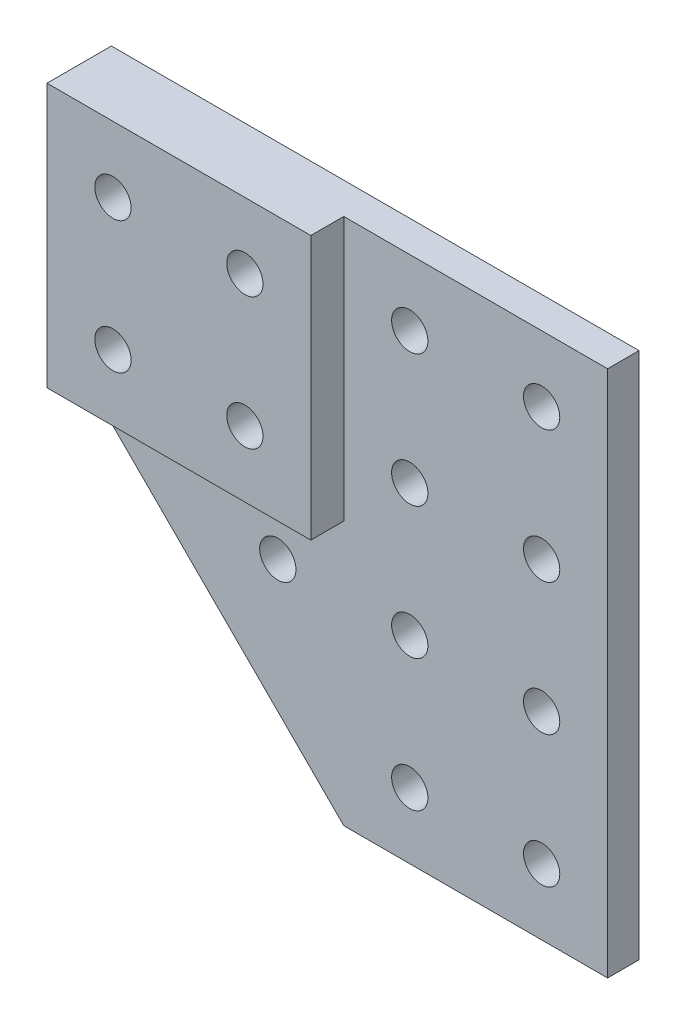
ISO-10303-21;
HEADER;
FILE_DESCRIPTION(('STEP AP214'),'2;1');
FILE_NAME('part.step','',(''),(''),'','','');
FILE_SCHEMA(('AUTOMOTIVE_DESIGN { 1 0 10303 214 1 1 1 1 }'));
ENDSEC;
DATA;
#1=APPLICATION_CONTEXT('core data for automotive mechanical design processes');
#2=APPLICATION_PROTOCOL_DEFINITION('international standard','automotive_design',2000,#1);
#3=PRODUCT_CONTEXT('',#1,'mechanical');
#4=PRODUCT('Part','Part','',(#3));
#5=PRODUCT_RELATED_PRODUCT_CATEGORY('part','',(#4));
#6=PRODUCT_DEFINITION_FORMATION('','',#4);
#7=PRODUCT_DEFINITION_CONTEXT('part definition',#1,'design');
#8=PRODUCT_DEFINITION('design','',#6,#7);
#9=PRODUCT_DEFINITION_SHAPE('','',#8);
#10=(LENGTH_UNIT() NAMED_UNIT(*) SI_UNIT(.MILLI.,.METRE.));
#11=(NAMED_UNIT(*) PLANE_ANGLE_UNIT() SI_UNIT($,.RADIAN.));
#12=(NAMED_UNIT(*) SI_UNIT($,.STERADIAN.) SOLID_ANGLE_UNIT());
#13=UNCERTAINTY_MEASURE_WITH_UNIT(LENGTH_MEASURE(1.E-05),#10,'distance_accuracy_value','');
#14=(GEOMETRIC_REPRESENTATION_CONTEXT(3) GLOBAL_UNCERTAINTY_ASSIGNED_CONTEXT((#13)) GLOBAL_UNIT_ASSIGNED_CONTEXT((#10,
#11,#12)) REPRESENTATION_CONTEXT('',''));
#15=CARTESIAN_POINT('',(0.,0.,0.));
#16=DIRECTION('',(0.,0.,1.));
#17=DIRECTION('',(1.,0.,0.));
#18=AXIS2_PLACEMENT_3D('',#15,#16,#17);
#19=CARTESIAN_POINT('',(0.,0.,0.));
#20=DIRECTION('',(0.,0.,-1.));
#21=DIRECTION('',(1.,0.,0.));
#22=AXIS2_PLACEMENT_3D('',#19,#20,#21);
#23=PLANE('',#22);
#24=CARTESIAN_POINT('',(50.,70.,0.));
#25=DIRECTION('',(0.,0.,1.));
#26=DIRECTION('',(1.,0.,0.));
#27=AXIS2_PLACEMENT_3D('',#24,#25,#26);
#28=CIRCLE('',#27,2.74999999999999);
#29=CARTESIAN_POINT('',(52.75,70.,0.));
#30=VERTEX_POINT('',#29);
#31=EDGE_CURVE('E223',#30,#30,#28,.T.);
#32=ORIENTED_EDGE('',*,*,#31,.F.);
#33=EDGE_LOOP('',(#32));
#34=FACE_BOUND('',#33,.T.);
#35=CARTESIAN_POINT('',(70.,70.,0.));
#36=DIRECTION('',(0.,0.,1.));
#37=DIRECTION('',(1.,0.,0.));
#38=AXIS2_PLACEMENT_3D('',#35,#36,#37);
#39=CIRCLE('',#38,2.75);
#40=CARTESIAN_POINT('',(72.75,70.,0.));
#41=VERTEX_POINT('',#40);
#42=EDGE_CURVE('E217',#41,#41,#39,.T.);
#43=ORIENTED_EDGE('',*,*,#42,.F.);
#44=EDGE_LOOP('',(#43));
#45=FACE_BOUND('',#44,.T.);
#46=CARTESIAN_POINT('',(50.0000000000002,50.,0.));
#47=DIRECTION('',(0.,0.,1.));
#48=DIRECTION('',(1.,0.,0.));
#49=AXIS2_PLACEMENT_3D('',#46,#47,#48);
#50=CIRCLE('',#49,2.74999999999999);
#51=CARTESIAN_POINT('',(52.7500000000002,50.,0.));
#52=VERTEX_POINT('',#51);
#53=EDGE_CURVE('E205',#52,#52,#50,.T.);
#54=ORIENTED_EDGE('',*,*,#53,.F.);
#55=EDGE_LOOP('',(#54));
#56=FACE_BOUND('',#55,.T.);
#57=CARTESIAN_POINT('',(70.0000000000002,50.,0.));
#58=DIRECTION('',(0.,0.,1.));
#59=DIRECTION('',(1.,0.,0.));
#60=AXIS2_PLACEMENT_3D('',#57,#58,#59);
#61=CIRCLE('',#60,2.75);
#62=CARTESIAN_POINT('',(72.7500000000002,50.,0.));
#63=VERTEX_POINT('',#62);
#64=EDGE_CURVE('E199',#63,#63,#61,.T.);
#65=ORIENTED_EDGE('',*,*,#64,.F.);
#66=EDGE_LOOP('',(#65));
#67=FACE_BOUND('',#66,.T.);
#68=CARTESIAN_POINT('',(30.0000000000004,30.,0.));
#69=DIRECTION('',(0.,0.,1.));
#70=DIRECTION('',(1.,0.,0.));
#71=AXIS2_PLACEMENT_3D('',#68,#69,#70);
#72=CIRCLE('',#71,2.74999999999999);
#73=CARTESIAN_POINT('',(32.7500000000004,30.,0.));
#74=VERTEX_POINT('',#73);
#75=EDGE_CURVE('E193',#74,#74,#72,.T.);
#76=ORIENTED_EDGE('',*,*,#75,.F.);
#77=EDGE_LOOP('',(#76));
#78=FACE_BOUND('',#77,.T.);
#79=CARTESIAN_POINT('',(50.0000000000004,30.,0.));
#80=DIRECTION('',(0.,0.,1.));
#81=DIRECTION('',(1.,0.,0.));
#82=AXIS2_PLACEMENT_3D('',#79,#80,#81);
#83=CIRCLE('',#82,2.74999999999999);
#84=CARTESIAN_POINT('',(52.7500000000004,30.,0.));
#85=VERTEX_POINT('',#84);
#86=EDGE_CURVE('E187',#85,#85,#83,.T.);
#87=ORIENTED_EDGE('',*,*,#86,.F.);
#88=EDGE_LOOP('',(#87));
#89=FACE_BOUND('',#88,.T.);
#90=CARTESIAN_POINT('',(70.0000000000004,30.,0.));
#91=DIRECTION('',(0.,0.,1.));
#92=DIRECTION('',(1.,0.,0.));
#93=AXIS2_PLACEMENT_3D('',#90,#91,#92);
#94=CIRCLE('',#93,2.75);
#95=CARTESIAN_POINT('',(72.7500000000004,30.,0.));
#96=VERTEX_POINT('',#95);
#97=EDGE_CURVE('E181',#96,#96,#94,.T.);
#98=ORIENTED_EDGE('',*,*,#97,.F.);
#99=EDGE_LOOP('',(#98));
#100=FACE_BOUND('',#99,.T.);
#101=CARTESIAN_POINT('',(50.0000000000006,10.,0.));
#102=DIRECTION('',(0.,0.,1.));
#103=DIRECTION('',(1.,0.,0.));
#104=AXIS2_PLACEMENT_3D('',#101,#102,#103);
#105=CIRCLE('',#104,2.74999999999999);
#106=CARTESIAN_POINT('',(52.7500000000006,10.,0.));
#107=VERTEX_POINT('',#106);
#108=EDGE_CURVE('E175',#107,#107,#105,.T.);
#109=ORIENTED_EDGE('',*,*,#108,.F.);
#110=EDGE_LOOP('',(#109));
#111=FACE_BOUND('',#110,.T.);
#112=CARTESIAN_POINT('',(70.0000000000006,10.,0.));
#113=DIRECTION('',(0.,0.,1.));
#114=DIRECTION('',(1.,0.,0.));
#115=AXIS2_PLACEMENT_3D('',#112,#113,#114);
#116=CIRCLE('',#115,2.75);
#117=CARTESIAN_POINT('',(72.7500000000006,10.,0.));
#118=VERTEX_POINT('',#117);
#119=EDGE_CURVE('E169',#118,#118,#116,.T.);
#120=ORIENTED_EDGE('',*,*,#119,.F.);
#121=EDGE_LOOP('',(#120));
#122=FACE_BOUND('',#121,.T.);
#123=DIRECTION('',(0.,-1.,0.));
#124=VECTOR('',#123,1.);
#125=CARTESIAN_POINT('',(40.,0.,0.));
#126=LINE('',#125,#124);
#127=CARTESIAN_POINT('',(40.,80.,0.));
#128=VERTEX_POINT('',#127);
#129=CARTESIAN_POINT('',(40.,40.,0.));
#130=VERTEX_POINT('',#129);
#131=EDGE_CURVE('E155',#128,#130,#126,.T.);
#132=ORIENTED_EDGE('',*,*,#131,.T.);
#133=DIRECTION('',(1.,0.,0.));
#134=VECTOR('',#133,1.);
#135=CARTESIAN_POINT('',(0.,40.,0.));
#136=LINE('',#135,#134);
#137=CARTESIAN_POINT('',(0.,40.,0.));
#138=VERTEX_POINT('',#137);
#139=EDGE_CURVE('E152',#138,#130,#136,.T.);
#140=ORIENTED_EDGE('',*,*,#139,.F.);
#141=DIRECTION('',(-0.707106781186548,0.707106781186548,0.));
#142=VECTOR('',#141,1.);
#143=CARTESIAN_POINT('',(20.,20.,0.));
#144=LINE('',#143,#142);
#145=CARTESIAN_POINT('',(40.,0.,0.));
#146=VERTEX_POINT('',#145);
#147=EDGE_CURVE('E128',#146,#138,#144,.T.);
#148=ORIENTED_EDGE('',*,*,#147,.F.);
#149=DIRECTION('',(1.,0.,0.));
#150=VECTOR('',#149,1.);
#151=CARTESIAN_POINT('',(0.,0.,0.));
#152=LINE('',#151,#150);
#153=CARTESIAN_POINT('',(80.,0.,0.));
#154=VERTEX_POINT('',#153);
#155=EDGE_CURVE('E120',#146,#154,#152,.T.);
#156=ORIENTED_EDGE('',*,*,#155,.T.);
#157=DIRECTION('',(0.,1.,0.));
#158=VECTOR('',#157,1.);
#159=CARTESIAN_POINT('',(80.,0.,0.));
#160=LINE('',#159,#158);
#161=CARTESIAN_POINT('',(80.,80.,0.));
#162=VERTEX_POINT('',#161);
#163=EDGE_CURVE('E123',#154,#162,#160,.T.);
#164=ORIENTED_EDGE('',*,*,#163,.T.);
#165=DIRECTION('',(1.,0.,0.));
#166=VECTOR('',#165,1.);
#167=CARTESIAN_POINT('',(0.,80.,0.));
#168=LINE('',#167,#166);
#169=EDGE_CURVE('E126',#128,#162,#168,.T.);
#170=ORIENTED_EDGE('',*,*,#169,.F.);
#171=EDGE_LOOP('',(#132,#140,#148,#156,#164,#170));
#172=FACE_BOUND('',#171,.T.);
#173=ADVANCED_FACE('F35',(#34,#45,#56,#67,#78,#89,#100,#111,#122,#172),#23,.F.);
#174=CARTESIAN_POINT('',(0.,0.,-4.7625));
#175=DIRECTION('',(0.,1.,0.));
#176=DIRECTION('',(0.,0.,-1.));
#177=AXIS2_PLACEMENT_3D('',#174,#175,#176);
#178=PLANE('',#177);
#179=ORIENTED_EDGE('',*,*,#155,.F.);
#180=DIRECTION('',(0.,0.,1.));
#181=VECTOR('',#180,1.);
#182=CARTESIAN_POINT('',(40.,0.,-4.7625));
#183=LINE('',#182,#181);
#184=CARTESIAN_POINT('',(40.,0.,-4.7625));
#185=VERTEX_POINT('',#184);
#186=EDGE_CURVE('E74',#185,#146,#183,.T.);
#187=ORIENTED_EDGE('',*,*,#186,.F.);
#188=DIRECTION('',(1.,0.,0.));
#189=VECTOR('',#188,1.);
#190=CARTESIAN_POINT('',(0.,0.,-4.7625));
#191=LINE('',#190,#189);
#192=CARTESIAN_POINT('',(80.,0.,-4.7625));
#193=VERTEX_POINT('',#192);
#194=EDGE_CURVE('E115',#185,#193,#191,.T.);
#195=ORIENTED_EDGE('',*,*,#194,.T.);
#196=DIRECTION('',(0.,0.,1.));
#197=VECTOR('',#196,1.);
#198=CARTESIAN_POINT('',(80.,0.,-4.7625));
#199=LINE('',#198,#197);
#200=EDGE_CURVE('E11',#193,#154,#199,.T.);
#201=ORIENTED_EDGE('',*,*,#200,.T.);
#202=EDGE_LOOP('',(#179,#187,#195,#201));
#203=FACE_BOUND('',#202,.T.);
#204=ADVANCED_FACE('F37',(#203),#178,.F.);
#205=CARTESIAN_POINT('',(80.,0.,-4.7625));
#206=DIRECTION('',(-1.,0.,0.));
#207=DIRECTION('',(0.,0.,-1.));
#208=AXIS2_PLACEMENT_3D('',#205,#206,#207);
#209=PLANE('',#208);
#210=ORIENTED_EDGE('',*,*,#163,.F.);
#211=ORIENTED_EDGE('',*,*,#200,.F.);
#212=DIRECTION('',(0.,1.,0.));
#213=VECTOR('',#212,1.);
#214=CARTESIAN_POINT('',(80.,0.,-4.7625));
#215=LINE('',#214,#213);
#216=CARTESIAN_POINT('',(80.,80.,-4.7625));
#217=VERTEX_POINT('',#216);
#218=EDGE_CURVE('E82',#193,#217,#215,.T.);
#219=ORIENTED_EDGE('',*,*,#218,.T.);
#220=DIRECTION('',(0.,0.,1.));
#221=VECTOR('',#220,1.);
#222=CARTESIAN_POINT('',(80.,80.,-4.7625));
#223=LINE('',#222,#221);
#224=EDGE_CURVE('E43',#217,#162,#223,.T.);
#225=ORIENTED_EDGE('',*,*,#224,.T.);
#226=EDGE_LOOP('',(#210,#211,#219,#225));
#227=FACE_BOUND('',#226,.T.);
#228=ADVANCED_FACE('F133',(#227),#209,.F.);
#229=CARTESIAN_POINT('',(0.,80.,-4.7625));
#230=DIRECTION('',(0.,1.,0.));
#231=DIRECTION('',(0.,0.,-1.));
#232=AXIS2_PLACEMENT_3D('',#229,#230,#231);
#233=PLANE('',#232);
#234=ORIENTED_EDGE('',*,*,#169,.T.);
#235=ORIENTED_EDGE('',*,*,#224,.F.);
#236=DIRECTION('',(1.,0.,0.));
#237=VECTOR('',#236,1.);
#238=CARTESIAN_POINT('',(0.,80.,-4.7625));
#239=LINE('',#238,#237);
#240=CARTESIAN_POINT('',(0.,80.,-4.7625));
#241=VERTEX_POINT('',#240);
#242=EDGE_CURVE('E94',#241,#217,#239,.T.);
#243=ORIENTED_EDGE('',*,*,#242,.F.);
#244=DIRECTION('',(0.,0.,1.));
#245=VECTOR('',#244,1.);
#246=CARTESIAN_POINT('',(0.,80.,-4.7625));
#247=LINE('',#246,#245);
#248=CARTESIAN_POINT('',(0.,80.,5.));
#249=VERTEX_POINT('',#248);
#250=EDGE_CURVE('E101',#241,#249,#247,.T.);
#251=ORIENTED_EDGE('',*,*,#250,.T.);
#252=DIRECTION('',(1.,0.,0.));
#253=VECTOR('',#252,1.);
#254=CARTESIAN_POINT('',(0.,80.,5.));
#255=LINE('',#254,#253);
#256=CARTESIAN_POINT('',(40.,80.,5.));
#257=VERTEX_POINT('',#256);
#258=EDGE_CURVE('E161',#249,#257,#255,.T.);
#259=ORIENTED_EDGE('',*,*,#258,.T.);
#260=DIRECTION('',(0.,0.,-1.));
#261=VECTOR('',#260,1.);
#262=CARTESIAN_POINT('',(40.,80.,5.));
#263=LINE('',#262,#261);
#264=EDGE_CURVE('E138',#257,#128,#263,.T.);
#265=ORIENTED_EDGE('',*,*,#264,.T.);
#266=EDGE_LOOP('',(#234,#235,#243,#251,#259,#265));
#267=FACE_BOUND('',#266,.T.);
#268=ADVANCED_FACE('F113',(#267),#233,.T.);
#269=CARTESIAN_POINT('',(0.,0.,-4.7625));
#270=DIRECTION('',(-1.,0.,0.));
#271=DIRECTION('',(0.,0.,-1.));
#272=AXIS2_PLACEMENT_3D('',#269,#270,#271);
#273=PLANE('',#272);
#274=ORIENTED_EDGE('',*,*,#250,.F.);
#275=DIRECTION('',(0.,1.,0.));
#276=VECTOR('',#275,1.);
#277=CARTESIAN_POINT('',(0.,0.,-4.7625));
#278=LINE('',#277,#276);
#279=CARTESIAN_POINT('',(0.,40.,-4.7625));
#280=VERTEX_POINT('',#279);
#281=EDGE_CURVE('E90',#280,#241,#278,.T.);
#282=ORIENTED_EDGE('',*,*,#281,.F.);
#283=DIRECTION('',(0.,0.,1.));
#284=VECTOR('',#283,1.);
#285=CARTESIAN_POINT('',(0.,40.,-4.7625));
#286=LINE('',#285,#284);
#287=EDGE_CURVE('E110',#280,#138,#286,.T.);
#288=ORIENTED_EDGE('',*,*,#287,.T.);
#289=DIRECTION('',(0.,0.,-1.));
#290=VECTOR('',#289,1.);
#291=CARTESIAN_POINT('',(0.,40.,5.));
#292=LINE('',#291,#290);
#293=CARTESIAN_POINT('',(0.,40.,5.));
#294=VERTEX_POINT('',#293);
#295=EDGE_CURVE('E147',#294,#138,#292,.T.);
#296=ORIENTED_EDGE('',*,*,#295,.F.);
#297=DIRECTION('',(0.,1.,0.));
#298=VECTOR('',#297,1.);
#299=CARTESIAN_POINT('',(0.,0.,5.));
#300=LINE('',#299,#298);
#301=EDGE_CURVE('E106',#294,#249,#300,.T.);
#302=ORIENTED_EDGE('',*,*,#301,.T.);
#303=EDGE_LOOP('',(#274,#282,#288,#296,#302));
#304=FACE_BOUND('',#303,.T.);
#305=ADVANCED_FACE('F102',(#304),#273,.T.);
#306=CARTESIAN_POINT('',(20.,20.,-4.7625));
#307=DIRECTION('',(-0.707106781186548,-0.707106781186548,0.));
#308=DIRECTION('',(0.707106781186548,-0.707106781186548,0.));
#309=AXIS2_PLACEMENT_3D('',#306,#307,#308);
#310=PLANE('',#309);
#311=ORIENTED_EDGE('',*,*,#147,.T.);
#312=ORIENTED_EDGE('',*,*,#287,.F.);
#313=DIRECTION('',(-0.707106781186548,0.707106781186548,0.));
#314=VECTOR('',#313,1.);
#315=CARTESIAN_POINT('',(20.,20.,-4.7625));
#316=LINE('',#315,#314);
#317=EDGE_CURVE('E59',#185,#280,#316,.T.);
#318=ORIENTED_EDGE('',*,*,#317,.F.);
#319=ORIENTED_EDGE('',*,*,#186,.T.);
#320=EDGE_LOOP('',(#311,#312,#318,#319));
#321=FACE_BOUND('',#320,.T.);
#322=ADVANCED_FACE('F266',(#321),#310,.T.);
#323=CARTESIAN_POINT('',(0.,0.,-4.7625));
#324=DIRECTION('',(0.,0.,-1.));
#325=DIRECTION('',(1.,0.,0.));
#326=AXIS2_PLACEMENT_3D('',#323,#324,#325);
#327=PLANE('',#326);
#328=CARTESIAN_POINT('',(10.,70.,-4.7625));
#329=DIRECTION('',(0.,0.,1.));
#330=DIRECTION('',(1.,0.,0.));
#331=AXIS2_PLACEMENT_3D('',#328,#329,#330);
#332=CIRCLE('',#331,2.74999999999999);
#333=CARTESIAN_POINT('',(12.75,70.,-4.7625));
#334=VERTEX_POINT('',#333);
#335=EDGE_CURVE('E238',#334,#334,#332,.T.);
#336=ORIENTED_EDGE('',*,*,#335,.T.);
#337=EDGE_LOOP('',(#336));
#338=FACE_BOUND('',#337,.T.);
#339=CARTESIAN_POINT('',(30.,70.,-4.7625));
#340=DIRECTION('',(0.,0.,1.));
#341=DIRECTION('',(1.,0.,0.));
#342=AXIS2_PLACEMENT_3D('',#339,#340,#341);
#343=CIRCLE('',#342,2.74999999999999);
#344=CARTESIAN_POINT('',(32.75,70.,-4.7625));
#345=VERTEX_POINT('',#344);
#346=EDGE_CURVE('E232',#345,#345,#343,.T.);
#347=ORIENTED_EDGE('',*,*,#346,.T.);
#348=EDGE_LOOP('',(#347));
#349=FACE_BOUND('',#348,.T.);
#350=CARTESIAN_POINT('',(50.,70.,-4.7625));
#351=DIRECTION('',(0.,0.,1.));
#352=DIRECTION('',(1.,0.,0.));
#353=AXIS2_PLACEMENT_3D('',#350,#351,#352);
#354=CIRCLE('',#353,2.74999999999999);
#355=CARTESIAN_POINT('',(52.75,70.,-4.7625));
#356=VERTEX_POINT('',#355);
#357=EDGE_CURVE('E226',#356,#356,#354,.T.);
#358=ORIENTED_EDGE('',*,*,#357,.T.);
#359=EDGE_LOOP('',(#358));
#360=FACE_BOUND('',#359,.T.);
#361=CARTESIAN_POINT('',(70.,70.,-4.7625));
#362=DIRECTION('',(0.,0.,1.));
#363=DIRECTION('',(1.,0.,0.));
#364=AXIS2_PLACEMENT_3D('',#361,#362,#363);
#365=CIRCLE('',#364,2.74999999999999);
#366=CARTESIAN_POINT('',(72.75,70.,-4.7625));
#367=VERTEX_POINT('',#366);
#368=EDGE_CURVE('E220',#367,#367,#365,.T.);
#369=ORIENTED_EDGE('',*,*,#368,.T.);
#370=EDGE_LOOP('',(#369));
#371=FACE_BOUND('',#370,.T.);
#372=CARTESIAN_POINT('',(30.0000000000002,50.,-4.7625));
#373=DIRECTION('',(0.,0.,1.));
#374=DIRECTION('',(1.,0.,0.));
#375=AXIS2_PLACEMENT_3D('',#372,#373,#374);
#376=CIRCLE('',#375,2.74999999999999);
#377=CARTESIAN_POINT('',(32.7500000000002,50.,-4.7625));
#378=VERTEX_POINT('',#377);
#379=EDGE_CURVE('E214',#378,#378,#376,.T.);
#380=ORIENTED_EDGE('',*,*,#379,.T.);
#381=EDGE_LOOP('',(#380));
#382=FACE_BOUND('',#381,.T.);
#383=CARTESIAN_POINT('',(50.0000000000002,50.,-4.7625));
#384=DIRECTION('',(0.,0.,1.));
#385=DIRECTION('',(1.,0.,0.));
#386=AXIS2_PLACEMENT_3D('',#383,#384,#385);
#387=CIRCLE('',#386,2.74999999999999);
#388=CARTESIAN_POINT('',(52.7500000000002,50.,-4.7625));
#389=VERTEX_POINT('',#388);
#390=EDGE_CURVE('E208',#389,#389,#387,.T.);
#391=ORIENTED_EDGE('',*,*,#390,.T.);
#392=EDGE_LOOP('',(#391));
#393=FACE_BOUND('',#392,.T.);
#394=CARTESIAN_POINT('',(70.0000000000002,50.,-4.7625));
#395=DIRECTION('',(0.,0.,1.));
#396=DIRECTION('',(1.,0.,0.));
#397=AXIS2_PLACEMENT_3D('',#394,#395,#396);
#398=CIRCLE('',#397,2.74999999999999);
#399=CARTESIAN_POINT('',(72.7500000000002,50.,-4.7625));
#400=VERTEX_POINT('',#399);
#401=EDGE_CURVE('E202',#400,#400,#398,.T.);
#402=ORIENTED_EDGE('',*,*,#401,.T.);
#403=EDGE_LOOP('',(#402));
#404=FACE_BOUND('',#403,.T.);
#405=CARTESIAN_POINT('',(30.0000000000004,30.,-4.7625));
#406=DIRECTION('',(0.,0.,1.));
#407=DIRECTION('',(1.,0.,0.));
#408=AXIS2_PLACEMENT_3D('',#405,#406,#407);
#409=CIRCLE('',#408,2.74999999999999);
#410=CARTESIAN_POINT('',(32.7500000000004,30.,-4.7625));
#411=VERTEX_POINT('',#410);
#412=EDGE_CURVE('E196',#411,#411,#409,.T.);
#413=ORIENTED_EDGE('',*,*,#412,.T.);
#414=EDGE_LOOP('',(#413));
#415=FACE_BOUND('',#414,.T.);
#416=CARTESIAN_POINT('',(50.0000000000004,30.,-4.7625));
#417=DIRECTION('',(0.,0.,1.));
#418=DIRECTION('',(1.,0.,0.));
#419=AXIS2_PLACEMENT_3D('',#416,#417,#418);
#420=CIRCLE('',#419,2.74999999999999);
#421=CARTESIAN_POINT('',(52.7500000000004,30.,-4.7625));
#422=VERTEX_POINT('',#421);
#423=EDGE_CURVE('E190',#422,#422,#420,.T.);
#424=ORIENTED_EDGE('',*,*,#423,.T.);
#425=EDGE_LOOP('',(#424));
#426=FACE_BOUND('',#425,.T.);
#427=CARTESIAN_POINT('',(70.0000000000004,30.,-4.7625));
#428=DIRECTION('',(0.,0.,1.));
#429=DIRECTION('',(1.,0.,0.));
#430=AXIS2_PLACEMENT_3D('',#427,#428,#429);
#431=CIRCLE('',#430,2.74999999999999);
#432=CARTESIAN_POINT('',(72.7500000000004,30.,-4.7625));
#433=VERTEX_POINT('',#432);
#434=EDGE_CURVE('E184',#433,#433,#431,.T.);
#435=ORIENTED_EDGE('',*,*,#434,.T.);
#436=EDGE_LOOP('',(#435));
#437=FACE_BOUND('',#436,.T.);
#438=CARTESIAN_POINT('',(50.0000000000006,10.,-4.7625));
#439=DIRECTION('',(0.,0.,1.));
#440=DIRECTION('',(1.,0.,0.));
#441=AXIS2_PLACEMENT_3D('',#438,#439,#440);
#442=CIRCLE('',#441,2.74999999999999);
#443=CARTESIAN_POINT('',(52.7500000000006,10.,-4.7625));
#444=VERTEX_POINT('',#443);
#445=EDGE_CURVE('E178',#444,#444,#442,.T.);
#446=ORIENTED_EDGE('',*,*,#445,.T.);
#447=EDGE_LOOP('',(#446));
#448=FACE_BOUND('',#447,.T.);
#449=CARTESIAN_POINT('',(70.0000000000006,10.,-4.7625));
#450=DIRECTION('',(0.,0.,1.));
#451=DIRECTION('',(1.,0.,0.));
#452=AXIS2_PLACEMENT_3D('',#449,#450,#451);
#453=CIRCLE('',#452,2.74999999999999);
#454=CARTESIAN_POINT('',(72.7500000000006,10.,-4.7625));
#455=VERTEX_POINT('',#454);
#456=EDGE_CURVE('E172',#455,#455,#453,.T.);
#457=ORIENTED_EDGE('',*,*,#456,.T.);
#458=EDGE_LOOP('',(#457));
#459=FACE_BOUND('',#458,.T.);
#460=CARTESIAN_POINT('',(10.0000000000002,50.,-4.7625));
#461=DIRECTION('',(0.,0.,1.));
#462=DIRECTION('',(1.,0.,0.));
#463=AXIS2_PLACEMENT_3D('',#460,#461,#462);
#464=CIRCLE('',#463,2.74999999999999);
#465=CARTESIAN_POINT('',(12.7500000000002,50.,-4.7625));
#466=VERTEX_POINT('',#465);
#467=EDGE_CURVE('E166',#466,#466,#464,.T.);
#468=ORIENTED_EDGE('',*,*,#467,.T.);
#469=EDGE_LOOP('',(#468));
#470=FACE_BOUND('',#469,.T.);
#471=ORIENTED_EDGE('',*,*,#194,.F.);
#472=ORIENTED_EDGE('',*,*,#317,.T.);
#473=ORIENTED_EDGE('',*,*,#281,.T.);
#474=ORIENTED_EDGE('',*,*,#242,.T.);
#475=ORIENTED_EDGE('',*,*,#218,.F.);
#476=EDGE_LOOP('',(#471,#472,#473,#474,#475));
#477=FACE_BOUND('',#476,.T.);
#478=ADVANCED_FACE('F92',(#338,#349,#360,#371,#382,#393,#404,#415,#426,#437,#448,#459,#470,
#477),#327,.T.);
#479=CARTESIAN_POINT('',(40.,0.,5.));
#480=DIRECTION('',(-1.,0.,0.));
#481=DIRECTION('',(0.,0.,-1.));
#482=AXIS2_PLACEMENT_3D('',#479,#480,#481);
#483=PLANE('',#482);
#484=ORIENTED_EDGE('',*,*,#131,.F.);
#485=ORIENTED_EDGE('',*,*,#264,.F.);
#486=DIRECTION('',(0.,-1.,0.));
#487=VECTOR('',#486,1.);
#488=CARTESIAN_POINT('',(40.,0.,5.));
#489=LINE('',#488,#487);
#490=CARTESIAN_POINT('',(40.,40.,5.));
#491=VERTEX_POINT('',#490);
#492=EDGE_CURVE('E154',#257,#491,#489,.T.);
#493=ORIENTED_EDGE('',*,*,#492,.T.);
#494=DIRECTION('',(0.,0.,-1.));
#495=VECTOR('',#494,1.);
#496=CARTESIAN_POINT('',(40.,40.,5.));
#497=LINE('',#496,#495);
#498=EDGE_CURVE('E50',#491,#130,#497,.T.);
#499=ORIENTED_EDGE('',*,*,#498,.T.);
#500=EDGE_LOOP('',(#484,#485,#493,#499));
#501=FACE_BOUND('',#500,.T.);
#502=ADVANCED_FACE('F295',(#501),#483,.F.);
#503=CARTESIAN_POINT('',(0.,40.,5.));
#504=DIRECTION('',(0.,-1.,0.));
#505=DIRECTION('',(0.,0.,1.));
#506=AXIS2_PLACEMENT_3D('',#503,#504,#505);
#507=PLANE('',#506);
#508=ORIENTED_EDGE('',*,*,#139,.T.);
#509=ORIENTED_EDGE('',*,*,#498,.F.);
#510=DIRECTION('',(1.,0.,0.));
#511=VECTOR('',#510,1.);
#512=CARTESIAN_POINT('',(0.,40.,5.));
#513=LINE('',#512,#511);
#514=EDGE_CURVE('E148',#294,#491,#513,.T.);
#515=ORIENTED_EDGE('',*,*,#514,.F.);
#516=ORIENTED_EDGE('',*,*,#295,.T.);
#517=EDGE_LOOP('',(#508,#509,#515,#516));
#518=FACE_BOUND('',#517,.T.);
#519=ADVANCED_FACE('F301',(#518),#507,.T.);
#520=CARTESIAN_POINT('',(0.,0.,5.));
#521=DIRECTION('',(0.,0.,-1.));
#522=DIRECTION('',(1.,0.,0.));
#523=AXIS2_PLACEMENT_3D('',#520,#521,#522);
#524=PLANE('',#523);
#525=CARTESIAN_POINT('',(10.,70.,5.));
#526=DIRECTION('',(0.,0.,1.));
#527=DIRECTION('',(1.,0.,0.));
#528=AXIS2_PLACEMENT_3D('',#525,#526,#527);
#529=CIRCLE('',#528,2.75);
#530=CARTESIAN_POINT('',(12.75,70.,5.));
#531=VERTEX_POINT('',#530);
#532=EDGE_CURVE('E235',#531,#531,#529,.T.);
#533=ORIENTED_EDGE('',*,*,#532,.F.);
#534=EDGE_LOOP('',(#533));
#535=FACE_BOUND('',#534,.T.);
#536=CARTESIAN_POINT('',(30.,70.,5.));
#537=DIRECTION('',(0.,0.,1.));
#538=DIRECTION('',(1.,0.,0.));
#539=AXIS2_PLACEMENT_3D('',#536,#537,#538);
#540=CIRCLE('',#539,2.75);
#541=CARTESIAN_POINT('',(32.75,70.,5.));
#542=VERTEX_POINT('',#541);
#543=EDGE_CURVE('E229',#542,#542,#540,.T.);
#544=ORIENTED_EDGE('',*,*,#543,.F.);
#545=EDGE_LOOP('',(#544));
#546=FACE_BOUND('',#545,.T.);
#547=CARTESIAN_POINT('',(30.0000000000002,50.,5.));
#548=DIRECTION('',(0.,0.,1.));
#549=DIRECTION('',(1.,0.,0.));
#550=AXIS2_PLACEMENT_3D('',#547,#548,#549);
#551=CIRCLE('',#550,2.75);
#552=CARTESIAN_POINT('',(32.7500000000002,50.,5.));
#553=VERTEX_POINT('',#552);
#554=EDGE_CURVE('E211',#553,#553,#551,.T.);
#555=ORIENTED_EDGE('',*,*,#554,.F.);
#556=EDGE_LOOP('',(#555));
#557=FACE_BOUND('',#556,.T.);
#558=CARTESIAN_POINT('',(10.0000000000002,50.,5.));
#559=DIRECTION('',(0.,0.,1.));
#560=DIRECTION('',(1.,0.,0.));
#561=AXIS2_PLACEMENT_3D('',#558,#559,#560);
#562=CIRCLE('',#561,2.75);
#563=CARTESIAN_POINT('',(12.7500000000002,50.,5.));
#564=VERTEX_POINT('',#563);
#565=EDGE_CURVE('E157',#564,#564,#562,.T.);
#566=ORIENTED_EDGE('',*,*,#565,.F.);
#567=EDGE_LOOP('',(#566));
#568=FACE_BOUND('',#567,.T.);
#569=ORIENTED_EDGE('',*,*,#492,.F.);
#570=ORIENTED_EDGE('',*,*,#258,.F.);
#571=ORIENTED_EDGE('',*,*,#301,.F.);
#572=ORIENTED_EDGE('',*,*,#514,.T.);
#573=EDGE_LOOP('',(#569,#570,#571,#572));
#574=FACE_BOUND('',#573,.T.);
#575=ADVANCED_FACE('F307',(#535,#546,#557,#568,#574),#524,.F.);
#576=CARTESIAN_POINT('',(10.0000000000002,50.,-4.7625));
#577=DIRECTION('',(0.,0.,-1.));
#578=DIRECTION('',(1.,0.,0.));
#579=AXIS2_PLACEMENT_3D('',#576,#577,#578);
#580=CYLINDRICAL_SURFACE('',#579,2.74999999999999);
#581=ORIENTED_EDGE('',*,*,#565,.T.);
#582=EDGE_LOOP('',(#581));
#583=FACE_BOUND('',#582,.T.);
#584=ORIENTED_EDGE('',*,*,#467,.F.);
#585=EDGE_LOOP('',(#584));
#586=FACE_BOUND('',#585,.T.);
#587=ADVANCED_FACE('F315',(#583,#586),#580,.F.);
#588=CARTESIAN_POINT('',(70.0000000000006,10.,-4.7625));
#589=DIRECTION('',(0.,0.,-1.));
#590=DIRECTION('',(1.,0.,0.));
#591=AXIS2_PLACEMENT_3D('',#588,#589,#590);
#592=CYLINDRICAL_SURFACE('',#591,2.75);
#593=ORIENTED_EDGE('',*,*,#456,.F.);
#594=EDGE_LOOP('',(#593));
#595=FACE_BOUND('',#594,.T.);
#596=ORIENTED_EDGE('',*,*,#119,.T.);
#597=EDGE_LOOP('',(#596));
#598=FACE_BOUND('',#597,.T.);
#599=ADVANCED_FACE('F323',(#595,#598),#592,.F.);
#600=CARTESIAN_POINT('',(50.0000000000006,10.,-4.7625));
#601=DIRECTION('',(0.,0.,-1.));
#602=DIRECTION('',(1.,0.,0.));
#603=AXIS2_PLACEMENT_3D('',#600,#601,#602);
#604=CYLINDRICAL_SURFACE('',#603,2.74999999999999);
#605=ORIENTED_EDGE('',*,*,#445,.F.);
#606=EDGE_LOOP('',(#605));
#607=FACE_BOUND('',#606,.T.);
#608=ORIENTED_EDGE('',*,*,#108,.T.);
#609=EDGE_LOOP('',(#608));
#610=FACE_BOUND('',#609,.T.);
#611=ADVANCED_FACE('F331',(#607,#610),#604,.F.);
#612=CARTESIAN_POINT('',(70.0000000000004,30.,-4.7625));
#613=DIRECTION('',(0.,0.,-1.));
#614=DIRECTION('',(1.,0.,0.));
#615=AXIS2_PLACEMENT_3D('',#612,#613,#614);
#616=CYLINDRICAL_SURFACE('',#615,2.75);
#617=ORIENTED_EDGE('',*,*,#434,.F.);
#618=EDGE_LOOP('',(#617));
#619=FACE_BOUND('',#618,.T.);
#620=ORIENTED_EDGE('',*,*,#97,.T.);
#621=EDGE_LOOP('',(#620));
#622=FACE_BOUND('',#621,.T.);
#623=ADVANCED_FACE('F339',(#619,#622),#616,.F.);
#624=CARTESIAN_POINT('',(50.0000000000004,30.,-4.7625));
#625=DIRECTION('',(0.,0.,-1.));
#626=DIRECTION('',(1.,0.,0.));
#627=AXIS2_PLACEMENT_3D('',#624,#625,#626);
#628=CYLINDRICAL_SURFACE('',#627,2.74999999999999);
#629=ORIENTED_EDGE('',*,*,#423,.F.);
#630=EDGE_LOOP('',(#629));
#631=FACE_BOUND('',#630,.T.);
#632=ORIENTED_EDGE('',*,*,#86,.T.);
#633=EDGE_LOOP('',(#632));
#634=FACE_BOUND('',#633,.T.);
#635=ADVANCED_FACE('F347',(#631,#634),#628,.F.);
#636=CARTESIAN_POINT('',(30.0000000000004,30.,-4.7625));
#637=DIRECTION('',(0.,0.,-1.));
#638=DIRECTION('',(1.,0.,0.));
#639=AXIS2_PLACEMENT_3D('',#636,#637,#638);
#640=CYLINDRICAL_SURFACE('',#639,2.74999999999999);
#641=ORIENTED_EDGE('',*,*,#412,.F.);
#642=EDGE_LOOP('',(#641));
#643=FACE_BOUND('',#642,.T.);
#644=ORIENTED_EDGE('',*,*,#75,.T.);
#645=EDGE_LOOP('',(#644));
#646=FACE_BOUND('',#645,.T.);
#647=ADVANCED_FACE('F355',(#643,#646),#640,.F.);
#648=CARTESIAN_POINT('',(70.0000000000002,50.,-4.7625));
#649=DIRECTION('',(0.,0.,-1.));
#650=DIRECTION('',(1.,0.,0.));
#651=AXIS2_PLACEMENT_3D('',#648,#649,#650);
#652=CYLINDRICAL_SURFACE('',#651,2.75);
#653=ORIENTED_EDGE('',*,*,#401,.F.);
#654=EDGE_LOOP('',(#653));
#655=FACE_BOUND('',#654,.T.);
#656=ORIENTED_EDGE('',*,*,#64,.T.);
#657=EDGE_LOOP('',(#656));
#658=FACE_BOUND('',#657,.T.);
#659=ADVANCED_FACE('F363',(#655,#658),#652,.F.);
#660=CARTESIAN_POINT('',(50.0000000000002,50.,-4.7625));
#661=DIRECTION('',(0.,0.,-1.));
#662=DIRECTION('',(1.,0.,0.));
#663=AXIS2_PLACEMENT_3D('',#660,#661,#662);
#664=CYLINDRICAL_SURFACE('',#663,2.74999999999999);
#665=ORIENTED_EDGE('',*,*,#390,.F.);
#666=EDGE_LOOP('',(#665));
#667=FACE_BOUND('',#666,.T.);
#668=ORIENTED_EDGE('',*,*,#53,.T.);
#669=EDGE_LOOP('',(#668));
#670=FACE_BOUND('',#669,.T.);
#671=ADVANCED_FACE('F371',(#667,#670),#664,.F.);
#672=CARTESIAN_POINT('',(30.0000000000002,50.,-4.7625));
#673=DIRECTION('',(0.,0.,-1.));
#674=DIRECTION('',(1.,0.,0.));
#675=AXIS2_PLACEMENT_3D('',#672,#673,#674);
#676=CYLINDRICAL_SURFACE('',#675,2.74999999999999);
#677=ORIENTED_EDGE('',*,*,#554,.T.);
#678=EDGE_LOOP('',(#677));
#679=FACE_BOUND('',#678,.T.);
#680=ORIENTED_EDGE('',*,*,#379,.F.);
#681=EDGE_LOOP('',(#680));
#682=FACE_BOUND('',#681,.T.);
#683=ADVANCED_FACE('F379',(#679,#682),#676,.F.);
#684=CARTESIAN_POINT('',(70.,70.,-4.7625));
#685=DIRECTION('',(0.,0.,-1.));
#686=DIRECTION('',(1.,0.,0.));
#687=AXIS2_PLACEMENT_3D('',#684,#685,#686);
#688=CYLINDRICAL_SURFACE('',#687,2.75);
#689=ORIENTED_EDGE('',*,*,#368,.F.);
#690=EDGE_LOOP('',(#689));
#691=FACE_BOUND('',#690,.T.);
#692=ORIENTED_EDGE('',*,*,#42,.T.);
#693=EDGE_LOOP('',(#692));
#694=FACE_BOUND('',#693,.T.);
#695=ADVANCED_FACE('F387',(#691,#694),#688,.F.);
#696=CARTESIAN_POINT('',(50.,70.,-4.7625));
#697=DIRECTION('',(0.,0.,-1.));
#698=DIRECTION('',(1.,0.,0.));
#699=AXIS2_PLACEMENT_3D('',#696,#697,#698);
#700=CYLINDRICAL_SURFACE('',#699,2.74999999999999);
#701=ORIENTED_EDGE('',*,*,#357,.F.);
#702=EDGE_LOOP('',(#701));
#703=FACE_BOUND('',#702,.T.);
#704=ORIENTED_EDGE('',*,*,#31,.T.);
#705=EDGE_LOOP('',(#704));
#706=FACE_BOUND('',#705,.T.);
#707=ADVANCED_FACE('F252',(#703,#706),#700,.F.);
#708=CARTESIAN_POINT('',(30.,70.,-4.7625));
#709=DIRECTION('',(0.,0.,-1.));
#710=DIRECTION('',(1.,0.,0.));
#711=AXIS2_PLACEMENT_3D('',#708,#709,#710);
#712=CYLINDRICAL_SURFACE('',#711,2.74999999999999);
#713=ORIENTED_EDGE('',*,*,#543,.T.);
#714=EDGE_LOOP('',(#713));
#715=FACE_BOUND('',#714,.T.);
#716=ORIENTED_EDGE('',*,*,#346,.F.);
#717=EDGE_LOOP('',(#716));
#718=FACE_BOUND('',#717,.T.);
#719=ADVANCED_FACE('F246',(#715,#718),#712,.F.);
#720=CARTESIAN_POINT('',(10.,70.,-4.7625));
#721=DIRECTION('',(0.,0.,-1.));
#722=DIRECTION('',(1.,0.,0.));
#723=AXIS2_PLACEMENT_3D('',#720,#721,#722);
#724=CYLINDRICAL_SURFACE('',#723,2.74999999999999);
#725=ORIENTED_EDGE('',*,*,#532,.T.);
#726=EDGE_LOOP('',(#725));
#727=FACE_BOUND('',#726,.T.);
#728=ORIENTED_EDGE('',*,*,#335,.F.);
#729=EDGE_LOOP('',(#728));
#730=FACE_BOUND('',#729,.T.);
#731=ADVANCED_FACE('F244',(#727,#730),#724,.F.);
#732=CLOSED_SHELL('',(#173,#204,#228,#268,#305,#322,#478,#502,#519,#575,#587,#599,#611,#623,
#635,#647,#659,#671,#683,#695,#707,#719,#731));
#733=MANIFOLD_SOLID_BREP('B2',#732);
#734=ADVANCED_BREP_SHAPE_REPRESENTATION('',(#18,#733),#14);
#735=SHAPE_DEFINITION_REPRESENTATION(#9,#734);
ENDSEC;
END-ISO-10303-21;
